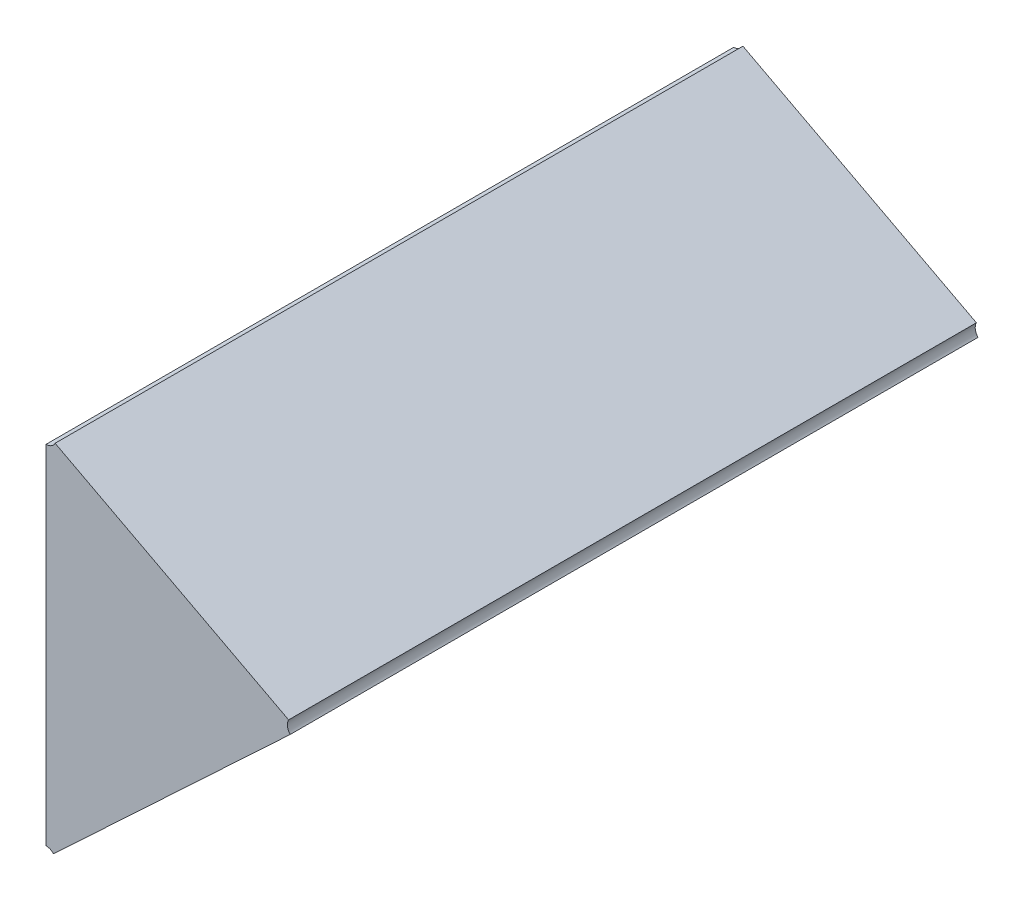
ISO-10303-21;
HEADER;
FILE_DESCRIPTION(('STEP AP214'),'2;1');
FILE_NAME('part.step','',(''),(''),'','','');
FILE_SCHEMA(('AUTOMOTIVE_DESIGN { 1 0 10303 214 1 1 1 1 }'));
ENDSEC;
DATA;
#1=APPLICATION_CONTEXT('core data for automotive mechanical design processes');
#2=APPLICATION_PROTOCOL_DEFINITION('international standard','automotive_design',2000,#1);
#3=PRODUCT_CONTEXT('',#1,'mechanical');
#4=PRODUCT('Part','Part','',(#3));
#5=PRODUCT_RELATED_PRODUCT_CATEGORY('part','',(#4));
#6=PRODUCT_DEFINITION_FORMATION('','',#4);
#7=PRODUCT_DEFINITION_CONTEXT('part definition',#1,'design');
#8=PRODUCT_DEFINITION('design','',#6,#7);
#9=PRODUCT_DEFINITION_SHAPE('','',#8);
#10=(LENGTH_UNIT() NAMED_UNIT(*) SI_UNIT(.MILLI.,.METRE.));
#11=(NAMED_UNIT(*) PLANE_ANGLE_UNIT() SI_UNIT($,.RADIAN.));
#12=(NAMED_UNIT(*) SI_UNIT($,.STERADIAN.) SOLID_ANGLE_UNIT());
#13=UNCERTAINTY_MEASURE_WITH_UNIT(LENGTH_MEASURE(1.E-05),#10,'distance_accuracy_value','');
#14=(GEOMETRIC_REPRESENTATION_CONTEXT(3) GLOBAL_UNCERTAINTY_ASSIGNED_CONTEXT((#13)) GLOBAL_UNIT_ASSIGNED_CONTEXT((#10,
#11,#12)) REPRESENTATION_CONTEXT('',''));
#15=CARTESIAN_POINT('',(0.,0.,0.));
#16=DIRECTION('',(0.,0.,1.));
#17=DIRECTION('',(1.,0.,0.));
#18=AXIS2_PLACEMENT_3D('',#15,#16,#17);
#19=CARTESIAN_POINT('',(-0.860258657100382,-0.709624283391395,0.));
#20=DIRECTION('',(0.,0.,-1.));
#21=DIRECTION('',(-1.,0.,0.));
#22=AXIS2_PLACEMENT_3D('',#19,#20,#21);
#23=PLANE('',#22);
#24=CARTESIAN_POINT('',(-0.871804418110991,-0.737952270258831,0.));
#25=DIRECTION('',(0.,0.,1.));
#26=DIRECTION('',(0.729821846781188,0.683637383384566,0.));
#27=AXIS2_PLACEMENT_3D('',#24,#25,#26);
#28=CIRCLE('',#27,0.0015);
#29=CARTESIAN_POINT('',(-0.870709685340819,-0.736926814183754,0.));
#30=VERTEX_POINT('',#29);
#31=CARTESIAN_POINT('',(-0.871804418110991,-0.736452270258831,0.));
#32=VERTEX_POINT('',#31);
#33=EDGE_CURVE('E11',#30,#32,#28,.T.);
#34=ORIENTED_EDGE('',*,*,#33,.T.);
#35=DIRECTION('',(0.,1.,0.));
#36=VECTOR('',#35,1.);
#37=CARTESIAN_POINT('',(-0.871804418110991,-0.736452270258831,0.));
#38=LINE('',#37,#36);
#39=CARTESIAN_POINT('',(-0.871804418110991,-0.685915298028327,0.));
#40=VERTEX_POINT('',#39);
#41=EDGE_CURVE('E83',#32,#40,#38,.T.);
#42=ORIENTED_EDGE('',*,*,#41,.T.);
#43=CARTESIAN_POINT('',(-0.871804418110991,-0.684415298028327,0.));
#44=DIRECTION('',(0.,0.,1.));
#45=DIRECTION('',(0.,-1.,0.));
#46=AXIS2_PLACEMENT_3D('',#43,#44,#45);
#47=CIRCLE('',#46,0.0015);
#48=CARTESIAN_POINT('',(-0.870476858909384,-0.685113572019128,0.));
#49=VERTEX_POINT('',#48);
#50=EDGE_CURVE('E107',#40,#49,#47,.T.);
#51=ORIENTED_EDGE('',*,*,#50,.T.);
#52=DIRECTION('',(0.885039467737861,-0.465515993867324,0.));
#53=VECTOR('',#52,1.);
#54=CARTESIAN_POINT('',(-0.870476858909384,-0.685113572019128,0.));
#55=LINE('',#54,#53);
#56=CARTESIAN_POINT('',(-0.836530543036463,-0.702968767801649,0.));
#57=VERTEX_POINT('',#56);
#58=EDGE_CURVE('E110',#49,#57,#55,.T.);
#59=ORIENTED_EDGE('',*,*,#58,.T.);
#60=CARTESIAN_POINT('',(-0.835202983834856,-0.70366704179245,0.));
#61=DIRECTION('',(0.,0.,1.));
#62=DIRECTION('',(-0.885039467737878,0.465515993867293,0.));
#63=AXIS2_PLACEMENT_3D('',#60,#61,#62);
#64=CIRCLE('',#63,0.0015);
#65=CARTESIAN_POINT('',(-0.836297716605028,-0.704692497867526,0.));
#66=VERTEX_POINT('',#65);
#67=EDGE_CURVE('E74',#57,#66,#64,.T.);
#68=ORIENTED_EDGE('',*,*,#67,.T.);
#69=DIRECTION('',(-0.72982184678132,-0.683637383384425,0.));
#70=VECTOR('',#69,1.);
#71=CARTESIAN_POINT('',(-0.836297716605028,-0.704692497867526,0.));
#72=LINE('',#71,#70);
#73=EDGE_CURVE('E103',#66,#30,#72,.T.);
#74=ORIENTED_EDGE('',*,*,#73,.T.);
#75=EDGE_LOOP('',(#34,#42,#51,#59,#68,#74));
#76=FACE_BOUND('',#75,.T.);
#77=ADVANCED_FACE('F17',(#76),#23,.T.);
#78=CARTESIAN_POINT('',(-0.871804418110991,-0.684415298028327,0.));
#79=DIRECTION('',(-0.465515993867323,-0.885039467737862,0.));
#80=DIRECTION('',(0.885039467737862,-0.465515993867323,0.));
#81=AXIS2_PLACEMENT_3D('',#78,#79,#80);
#82=PLANE('',#81);
#83=DIRECTION('',(0.,0.,-1.));
#84=VECTOR('',#83,1.);
#85=CARTESIAN_POINT('',(-0.836530543036463,-0.702968767801649,0.1));
#86=LINE('',#85,#84);
#87=CARTESIAN_POINT('',(-0.836530543036463,-0.702968767801649,0.1));
#88=VERTEX_POINT('',#87);
#89=EDGE_CURVE('E24',#88,#57,#86,.T.);
#90=ORIENTED_EDGE('',*,*,#89,.T.);
#91=ORIENTED_EDGE('',*,*,#58,.F.);
#92=DIRECTION('',(0.,0.,1.));
#93=VECTOR('',#92,1.);
#94=CARTESIAN_POINT('',(-0.870476858909384,-0.685113572019128,0.));
#95=LINE('',#94,#93);
#96=CARTESIAN_POINT('',(-0.870476858909384,-0.685113572019128,0.1));
#97=VERTEX_POINT('',#96);
#98=EDGE_CURVE('E68',#49,#97,#95,.T.);
#99=ORIENTED_EDGE('',*,*,#98,.T.);
#100=DIRECTION('',(0.885039467737861,-0.465515993867324,0.));
#101=VECTOR('',#100,1.);
#102=CARTESIAN_POINT('',(-0.870476858909384,-0.685113572019128,0.1));
#103=LINE('',#102,#101);
#104=EDGE_CURVE('E65',#97,#88,#103,.T.);
#105=ORIENTED_EDGE('',*,*,#104,.T.);
#106=EDGE_LOOP('',(#90,#91,#99,#105));
#107=FACE_BOUND('',#106,.T.);
#108=ADVANCED_FACE('F66',(#107),#82,.F.);
#109=CARTESIAN_POINT('',(-0.835202983834856,-0.70366704179245,0.));
#110=DIRECTION('',(-0.683637383384426,0.729821846781319,0.));
#111=DIRECTION('',(-0.729821846781319,-0.683637383384426,0.));
#112=AXIS2_PLACEMENT_3D('',#109,#110,#111);
#113=PLANE('',#112);
#114=DIRECTION('',(0.,0.,-1.));
#115=VECTOR('',#114,1.);
#116=CARTESIAN_POINT('',(-0.870709685340819,-0.736926814183754,0.1));
#117=LINE('',#116,#115);
#118=CARTESIAN_POINT('',(-0.870709685340819,-0.736926814183754,0.1));
#119=VERTEX_POINT('',#118);
#120=EDGE_CURVE('E112',#119,#30,#117,.T.);
#121=ORIENTED_EDGE('',*,*,#120,.T.);
#122=ORIENTED_EDGE('',*,*,#73,.F.);
#123=DIRECTION('',(0.,0.,1.));
#124=VECTOR('',#123,1.);
#125=CARTESIAN_POINT('',(-0.836297716605028,-0.704692497867526,0.));
#126=LINE('',#125,#124);
#127=CARTESIAN_POINT('',(-0.836297716605028,-0.704692497867526,0.1));
#128=VERTEX_POINT('',#127);
#129=EDGE_CURVE('E73',#66,#128,#126,.T.);
#130=ORIENTED_EDGE('',*,*,#129,.T.);
#131=DIRECTION('',(-0.72982184678132,-0.683637383384425,0.));
#132=VECTOR('',#131,1.);
#133=CARTESIAN_POINT('',(-0.836297716605028,-0.704692497867526,0.1));
#134=LINE('',#133,#132);
#135=EDGE_CURVE('E87',#128,#119,#134,.T.);
#136=ORIENTED_EDGE('',*,*,#135,.T.);
#137=EDGE_LOOP('',(#121,#122,#130,#136));
#138=FACE_BOUND('',#137,.T.);
#139=ADVANCED_FACE('F126',(#138),#113,.F.);
#140=CARTESIAN_POINT('',(-0.871804418110991,-0.737952270258831,0.));
#141=DIRECTION('',(1.,0.,0.));
#142=DIRECTION('',(0.,1.,0.));
#143=AXIS2_PLACEMENT_3D('',#140,#141,#142);
#144=PLANE('',#143);
#145=DIRECTION('',(0.,0.,1.));
#146=VECTOR('',#145,1.);
#147=CARTESIAN_POINT('',(-0.871804418110991,-0.736452270258831,0.));
#148=LINE('',#147,#146);
#149=CARTESIAN_POINT('',(-0.871804418110991,-0.736452270258831,0.1));
#150=VERTEX_POINT('',#149);
#151=EDGE_CURVE('E105',#32,#150,#148,.T.);
#152=ORIENTED_EDGE('',*,*,#151,.T.);
#153=DIRECTION('',(0.,1.,0.));
#154=VECTOR('',#153,1.);
#155=CARTESIAN_POINT('',(-0.871804418110991,-0.736452270258831,0.1));
#156=LINE('',#155,#154);
#157=CARTESIAN_POINT('',(-0.871804418110991,-0.685915298028327,0.1));
#158=VERTEX_POINT('',#157);
#159=EDGE_CURVE('E98',#150,#158,#156,.T.);
#160=ORIENTED_EDGE('',*,*,#159,.T.);
#161=DIRECTION('',(0.,0.,-1.));
#162=VECTOR('',#161,1.);
#163=CARTESIAN_POINT('',(-0.871804418110991,-0.685915298028327,0.1));
#164=LINE('',#163,#162);
#165=EDGE_CURVE('E88',#158,#40,#164,.T.);
#166=ORIENTED_EDGE('',*,*,#165,.T.);
#167=ORIENTED_EDGE('',*,*,#41,.F.);
#168=EDGE_LOOP('',(#152,#160,#166,#167));
#169=FACE_BOUND('',#168,.T.);
#170=ADVANCED_FACE('F118',(#169),#144,.F.);
#171=CARTESIAN_POINT('',(-0.860258657100382,-0.709624283391395,0.1));
#172=DIRECTION('',(0.,0.,-1.));
#173=DIRECTION('',(-1.,0.,0.));
#174=AXIS2_PLACEMENT_3D('',#171,#172,#173);
#175=PLANE('',#174);
#176=CARTESIAN_POINT('',(-0.871804418110991,-0.737952270258831,0.1));
#177=DIRECTION('',(0.,0.,-1.));
#178=DIRECTION('',(0.,1.,0.));
#179=AXIS2_PLACEMENT_3D('',#176,#177,#178);
#180=CIRCLE('',#179,0.0015);
#181=EDGE_CURVE('E100',#150,#119,#180,.T.);
#182=ORIENTED_EDGE('',*,*,#181,.T.);
#183=ORIENTED_EDGE('',*,*,#135,.F.);
#184=CARTESIAN_POINT('',(-0.835202983834856,-0.70366704179245,0.1));
#185=DIRECTION('',(0.,0.,-1.));
#186=DIRECTION('',(-0.729821846781545,-0.683637383384185,0.));
#187=AXIS2_PLACEMENT_3D('',#184,#185,#186);
#188=CIRCLE('',#187,0.0015);
#189=EDGE_CURVE('E81',#128,#88,#188,.T.);
#190=ORIENTED_EDGE('',*,*,#189,.T.);
#191=ORIENTED_EDGE('',*,*,#104,.F.);
#192=CARTESIAN_POINT('',(-0.871804418110991,-0.684415298028327,0.1));
#193=DIRECTION('',(0.,0.,-1.));
#194=DIRECTION('',(0.885039467737878,-0.465515993867293,0.));
#195=AXIS2_PLACEMENT_3D('',#192,#193,#194);
#196=CIRCLE('',#195,0.0015);
#197=EDGE_CURVE('E89',#97,#158,#196,.T.);
#198=ORIENTED_EDGE('',*,*,#197,.T.);
#199=ORIENTED_EDGE('',*,*,#159,.F.);
#200=EDGE_LOOP('',(#182,#183,#190,#191,#198,#199));
#201=FACE_BOUND('',#200,.T.);
#202=ADVANCED_FACE('F85',(#201),#175,.F.);
#203=CARTESIAN_POINT('',(-0.871804418110991,-0.684415298028327,0.1));
#204=DIRECTION('',(0.,0.,1.));
#205=DIRECTION('',(-1.,0.,0.));
#206=AXIS2_PLACEMENT_3D('',#203,#204,#205);
#207=CYLINDRICAL_SURFACE('',#206,0.0015);
#208=ORIENTED_EDGE('',*,*,#98,.F.);
#209=ORIENTED_EDGE('',*,*,#50,.F.);
#210=ORIENTED_EDGE('',*,*,#165,.F.);
#211=ORIENTED_EDGE('',*,*,#197,.F.);
#212=EDGE_LOOP('',(#208,#209,#210,#211));
#213=FACE_BOUND('',#212,.T.);
#214=ADVANCED_FACE('F121',(#213),#207,.F.);
#215=CARTESIAN_POINT('',(-0.835202983834856,-0.70366704179245,0.1));
#216=DIRECTION('',(0.,0.,1.));
#217=DIRECTION('',(-1.,0.,0.));
#218=AXIS2_PLACEMENT_3D('',#215,#216,#217);
#219=CYLINDRICAL_SURFACE('',#218,0.0015);
#220=ORIENTED_EDGE('',*,*,#89,.F.);
#221=ORIENTED_EDGE('',*,*,#189,.F.);
#222=ORIENTED_EDGE('',*,*,#129,.F.);
#223=ORIENTED_EDGE('',*,*,#67,.F.);
#224=EDGE_LOOP('',(#220,#221,#222,#223));
#225=FACE_BOUND('',#224,.T.);
#226=ADVANCED_FACE('F79',(#225),#219,.F.);
#227=CARTESIAN_POINT('',(-0.871804418110991,-0.737952270258831,0.1));
#228=DIRECTION('',(0.,0.,1.));
#229=DIRECTION('',(-1.,0.,0.));
#230=AXIS2_PLACEMENT_3D('',#227,#228,#229);
#231=CYLINDRICAL_SURFACE('',#230,0.0015);
#232=ORIENTED_EDGE('',*,*,#120,.F.);
#233=ORIENTED_EDGE('',*,*,#181,.F.);
#234=ORIENTED_EDGE('',*,*,#151,.F.);
#235=ORIENTED_EDGE('',*,*,#33,.F.);
#236=EDGE_LOOP('',(#232,#233,#234,#235));
#237=FACE_BOUND('',#236,.T.);
#238=ADVANCED_FACE('F127',(#237),#231,.F.);
#239=CLOSED_SHELL('',(#77,#108,#139,#170,#202,#214,#226,#238));
#240=MANIFOLD_SOLID_BREP('B1',#239);
#241=ADVANCED_BREP_SHAPE_REPRESENTATION('',(#18,#240),#14);
#242=SHAPE_DEFINITION_REPRESENTATION(#9,#241);
ENDSEC;
END-ISO-10303-21;
